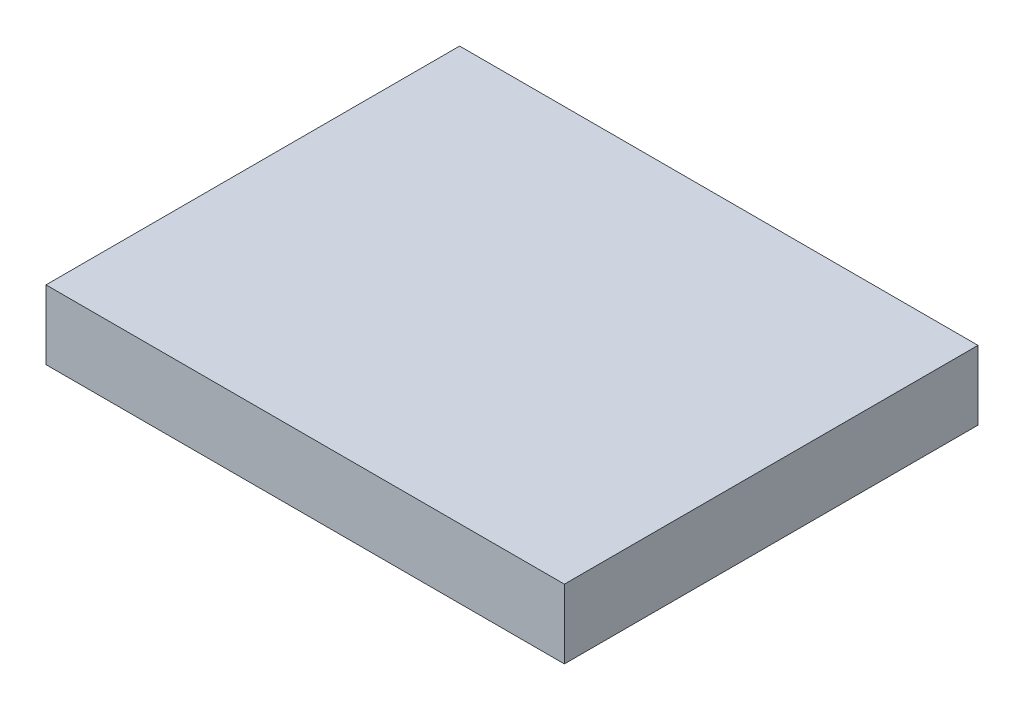
ISO-10303-21;
HEADER;
FILE_DESCRIPTION(('STEP AP214'),'2;1');
FILE_NAME('part.step','',(''),(''),'','','');
FILE_SCHEMA(('AUTOMOTIVE_DESIGN { 1 0 10303 214 1 1 1 1 }'));
ENDSEC;
DATA;
#1=APPLICATION_CONTEXT('core data for automotive mechanical design processes');
#2=APPLICATION_PROTOCOL_DEFINITION('international standard','automotive_design',2000,#1);
#3=PRODUCT_CONTEXT('',#1,'mechanical');
#4=PRODUCT('Part','Part','',(#3));
#5=PRODUCT_RELATED_PRODUCT_CATEGORY('part','',(#4));
#6=PRODUCT_DEFINITION_FORMATION('','',#4);
#7=PRODUCT_DEFINITION_CONTEXT('part definition',#1,'design');
#8=PRODUCT_DEFINITION('design','',#6,#7);
#9=PRODUCT_DEFINITION_SHAPE('','',#8);
#10=(LENGTH_UNIT() NAMED_UNIT(*) SI_UNIT(.MILLI.,.METRE.));
#11=(NAMED_UNIT(*) PLANE_ANGLE_UNIT() SI_UNIT($,.RADIAN.));
#12=(NAMED_UNIT(*) SI_UNIT($,.STERADIAN.) SOLID_ANGLE_UNIT());
#13=UNCERTAINTY_MEASURE_WITH_UNIT(LENGTH_MEASURE(1.E-05),#10,'distance_accuracy_value','');
#14=(GEOMETRIC_REPRESENTATION_CONTEXT(3) GLOBAL_UNCERTAINTY_ASSIGNED_CONTEXT((#13)) GLOBAL_UNIT_ASSIGNED_CONTEXT((#10,
#11,#12)) REPRESENTATION_CONTEXT('',''));
#15=CARTESIAN_POINT('',(0.,0.,0.));
#16=DIRECTION('',(0.,0.,1.));
#17=DIRECTION('',(1.,0.,0.));
#18=AXIS2_PLACEMENT_3D('',#15,#16,#17);
#19=CARTESIAN_POINT('',(0.,6.35,0.));
#20=DIRECTION('',(1.,0.,0.));
#21=DIRECTION('',(0.,0.,-1.));
#22=AXIS2_PLACEMENT_3D('',#19,#20,#21);
#23=PLANE('',#22);
#24=DIRECTION('',(0.,0.,1.));
#25=VECTOR('',#24,1.);
#26=CARTESIAN_POINT('',(0.,0.,0.));
#27=LINE('',#26,#25);
#28=CARTESIAN_POINT('',(0.,0.,-38.));
#29=VERTEX_POINT('',#28);
#30=CARTESIAN_POINT('',(0.,0.,0.));
#31=VERTEX_POINT('',#30);
#32=EDGE_CURVE('E96',#29,#31,#27,.T.);
#33=ORIENTED_EDGE('',*,*,#32,.T.);
#34=DIRECTION('',(0.,-1.,0.));
#35=VECTOR('',#34,1.);
#36=CARTESIAN_POINT('',(0.,6.35,0.));
#37=LINE('',#36,#35);
#38=CARTESIAN_POINT('',(0.,6.35,0.));
#39=VERTEX_POINT('',#38);
#40=EDGE_CURVE('E11',#39,#31,#37,.T.);
#41=ORIENTED_EDGE('',*,*,#40,.F.);
#42=DIRECTION('',(0.,0.,1.));
#43=VECTOR('',#42,1.);
#44=CARTESIAN_POINT('',(0.,6.35,0.));
#45=LINE('',#44,#43);
#46=CARTESIAN_POINT('',(0.,6.35,-38.));
#47=VERTEX_POINT('',#46);
#48=EDGE_CURVE('E84',#47,#39,#45,.T.);
#49=ORIENTED_EDGE('',*,*,#48,.F.);
#50=DIRECTION('',(0.,-1.,0.));
#51=VECTOR('',#50,1.);
#52=CARTESIAN_POINT('',(0.,6.35,-38.));
#53=LINE('',#52,#51);
#54=EDGE_CURVE('E92',#47,#29,#53,.T.);
#55=ORIENTED_EDGE('',*,*,#54,.T.);
#56=EDGE_LOOP('',(#33,#41,#49,#55));
#57=FACE_BOUND('',#56,.T.);
#58=ADVANCED_FACE('F33',(#57),#23,.F.);
#59=CARTESIAN_POINT('',(0.,6.35,0.));
#60=DIRECTION('',(0.,0.,-1.));
#61=DIRECTION('',(-1.,0.,0.));
#62=AXIS2_PLACEMENT_3D('',#59,#60,#61);
#63=PLANE('',#62);
#64=DIRECTION('',(1.,0.,0.));
#65=VECTOR('',#64,1.);
#66=CARTESIAN_POINT('',(0.,0.,0.));
#67=LINE('',#66,#65);
#68=CARTESIAN_POINT('',(47.625,0.,0.));
#69=VERTEX_POINT('',#68);
#70=EDGE_CURVE('E88',#31,#69,#67,.T.);
#71=ORIENTED_EDGE('',*,*,#70,.T.);
#72=DIRECTION('',(0.,-1.,0.));
#73=VECTOR('',#72,1.);
#74=CARTESIAN_POINT('',(47.625,6.35,0.));
#75=LINE('',#74,#73);
#76=CARTESIAN_POINT('',(47.625,6.35,0.));
#77=VERTEX_POINT('',#76);
#78=EDGE_CURVE('E41',#77,#69,#75,.T.);
#79=ORIENTED_EDGE('',*,*,#78,.F.);
#80=DIRECTION('',(1.,0.,0.));
#81=VECTOR('',#80,1.);
#82=CARTESIAN_POINT('',(0.,6.35,0.));
#83=LINE('',#82,#81);
#84=EDGE_CURVE('E79',#39,#77,#83,.T.);
#85=ORIENTED_EDGE('',*,*,#84,.F.);
#86=ORIENTED_EDGE('',*,*,#40,.T.);
#87=EDGE_LOOP('',(#71,#79,#85,#86));
#88=FACE_BOUND('',#87,.T.);
#89=ADVANCED_FACE('F87',(#88),#63,.F.);
#90=CARTESIAN_POINT('',(47.625,6.35,0.));
#91=DIRECTION('',(-1.,0.,0.));
#92=DIRECTION('',(0.,0.,1.));
#93=AXIS2_PLACEMENT_3D('',#90,#91,#92);
#94=PLANE('',#93);
#95=DIRECTION('',(0.,0.,-1.));
#96=VECTOR('',#95,1.);
#97=CARTESIAN_POINT('',(47.625,0.,0.));
#98=LINE('',#97,#96);
#99=CARTESIAN_POINT('',(47.625,0.,-38.));
#100=VERTEX_POINT('',#99);
#101=EDGE_CURVE('E66',#69,#100,#98,.T.);
#102=ORIENTED_EDGE('',*,*,#101,.T.);
#103=DIRECTION('',(0.,-1.,0.));
#104=VECTOR('',#103,1.);
#105=CARTESIAN_POINT('',(47.625,6.35,-38.));
#106=LINE('',#105,#104);
#107=CARTESIAN_POINT('',(47.625,6.35,-38.));
#108=VERTEX_POINT('',#107);
#109=EDGE_CURVE('E89',#108,#100,#106,.T.);
#110=ORIENTED_EDGE('',*,*,#109,.F.);
#111=DIRECTION('',(0.,0.,-1.));
#112=VECTOR('',#111,1.);
#113=CARTESIAN_POINT('',(47.625,6.35,0.));
#114=LINE('',#113,#112);
#115=EDGE_CURVE('E82',#77,#108,#114,.T.);
#116=ORIENTED_EDGE('',*,*,#115,.F.);
#117=ORIENTED_EDGE('',*,*,#78,.T.);
#118=EDGE_LOOP('',(#102,#110,#116,#117));
#119=FACE_BOUND('',#118,.T.);
#120=ADVANCED_FACE('F90',(#119),#94,.F.);
#121=CARTESIAN_POINT('',(0.,6.35,-38.));
#122=DIRECTION('',(0.,0.,1.));
#123=DIRECTION('',(1.,0.,0.));
#124=AXIS2_PLACEMENT_3D('',#121,#122,#123);
#125=PLANE('',#124);
#126=DIRECTION('',(-1.,0.,0.));
#127=VECTOR('',#126,1.);
#128=CARTESIAN_POINT('',(0.,0.,-38.));
#129=LINE('',#128,#127);
#130=EDGE_CURVE('E72',#100,#29,#129,.T.);
#131=ORIENTED_EDGE('',*,*,#130,.T.);
#132=ORIENTED_EDGE('',*,*,#54,.F.);
#133=DIRECTION('',(-1.,0.,0.));
#134=VECTOR('',#133,1.);
#135=CARTESIAN_POINT('',(0.,6.35,-38.));
#136=LINE('',#135,#134);
#137=EDGE_CURVE('E49',#108,#47,#136,.T.);
#138=ORIENTED_EDGE('',*,*,#137,.F.);
#139=ORIENTED_EDGE('',*,*,#109,.T.);
#140=EDGE_LOOP('',(#131,#132,#138,#139));
#141=FACE_BOUND('',#140,.T.);
#142=ADVANCED_FACE('F103',(#141),#125,.F.);
#143=CARTESIAN_POINT('',(0.,6.35,0.));
#144=DIRECTION('',(0.,-1.,0.));
#145=DIRECTION('',(0.,0.,-1.));
#146=AXIS2_PLACEMENT_3D('',#143,#144,#145);
#147=PLANE('',#146);
#148=ORIENTED_EDGE('',*,*,#48,.T.);
#149=ORIENTED_EDGE('',*,*,#84,.T.);
#150=ORIENTED_EDGE('',*,*,#115,.T.);
#151=ORIENTED_EDGE('',*,*,#137,.T.);
#152=EDGE_LOOP('',(#148,#149,#150,#151));
#153=FACE_BOUND('',#152,.T.);
#154=ADVANCED_FACE('F80',(#153),#147,.F.);
#155=CARTESIAN_POINT('',(0.,0.,0.));
#156=DIRECTION('',(0.,-1.,0.));
#157=DIRECTION('',(0.,0.,-1.));
#158=AXIS2_PLACEMENT_3D('',#155,#156,#157);
#159=PLANE('',#158);
#160=ORIENTED_EDGE('',*,*,#32,.F.);
#161=ORIENTED_EDGE('',*,*,#130,.F.);
#162=ORIENTED_EDGE('',*,*,#101,.F.);
#163=ORIENTED_EDGE('',*,*,#70,.F.);
#164=EDGE_LOOP('',(#160,#161,#162,#163));
#165=FACE_BOUND('',#164,.T.);
#166=ADVANCED_FACE('F106',(#165),#159,.T.);
#167=CLOSED_SHELL('',(#58,#89,#120,#142,#154,#166));
#168=MANIFOLD_SOLID_BREP('B2',#167);
#169=ADVANCED_BREP_SHAPE_REPRESENTATION('',(#18,#168),#14);
#170=SHAPE_DEFINITION_REPRESENTATION(#9,#169);
ENDSEC;
END-ISO-10303-21;
